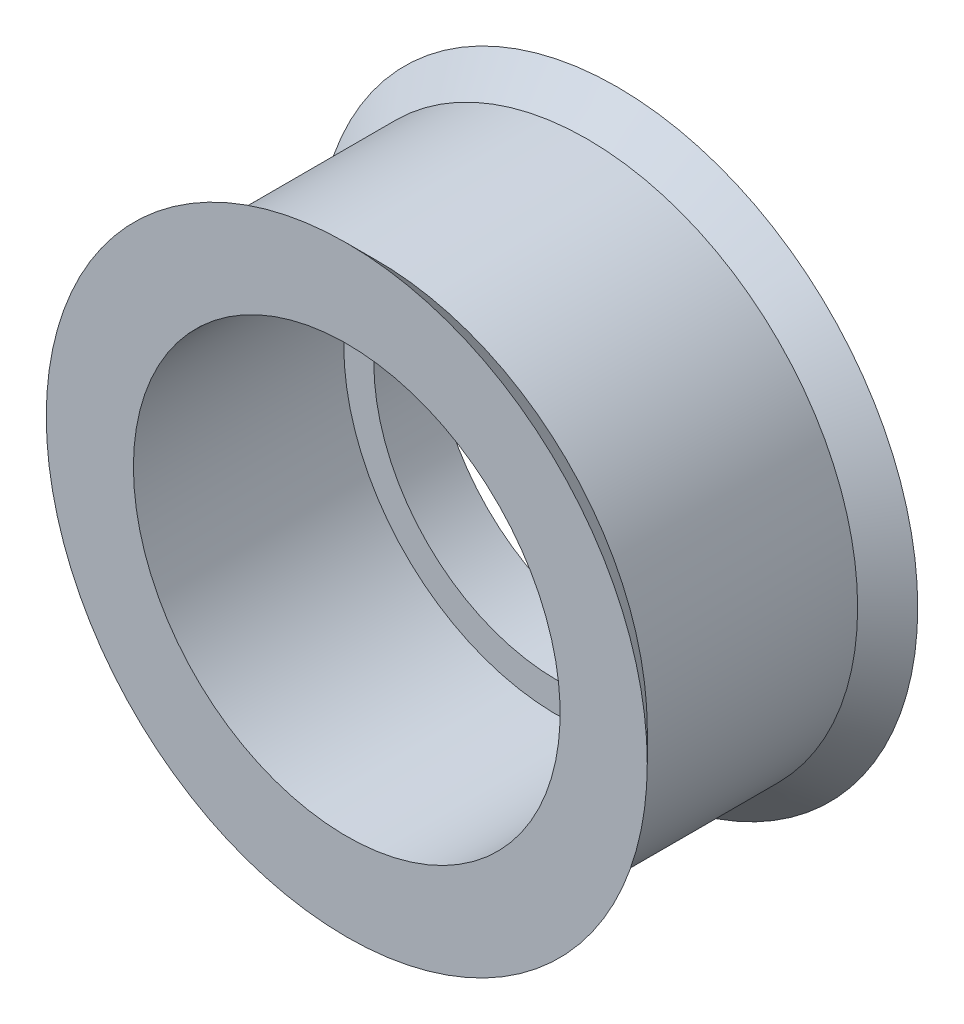
ISO-10303-21;
HEADER;
FILE_DESCRIPTION(('STEP AP214'),'2;1');
FILE_NAME('part.step','',(''),(''),'','','');
FILE_SCHEMA(('AUTOMOTIVE_DESIGN { 1 0 10303 214 1 1 1 1 }'));
ENDSEC;
DATA;
#1=APPLICATION_CONTEXT('core data for automotive mechanical design processes');
#2=APPLICATION_PROTOCOL_DEFINITION('international standard','automotive_design',2000,#1);
#3=PRODUCT_CONTEXT('',#1,'mechanical');
#4=PRODUCT('Part','Part','',(#3));
#5=PRODUCT_RELATED_PRODUCT_CATEGORY('part','',(#4));
#6=PRODUCT_DEFINITION_FORMATION('','',#4);
#7=PRODUCT_DEFINITION_CONTEXT('part definition',#1,'design');
#8=PRODUCT_DEFINITION('design','',#6,#7);
#9=PRODUCT_DEFINITION_SHAPE('','',#8);
#10=(LENGTH_UNIT() NAMED_UNIT(*) SI_UNIT(.MILLI.,.METRE.));
#11=(NAMED_UNIT(*) PLANE_ANGLE_UNIT() SI_UNIT($,.RADIAN.));
#12=(NAMED_UNIT(*) SI_UNIT($,.STERADIAN.) SOLID_ANGLE_UNIT());
#13=UNCERTAINTY_MEASURE_WITH_UNIT(LENGTH_MEASURE(1.E-05),#10,'distance_accuracy_value','');
#14=(GEOMETRIC_REPRESENTATION_CONTEXT(3) GLOBAL_UNCERTAINTY_ASSIGNED_CONTEXT((#13)) GLOBAL_UNIT_ASSIGNED_CONTEXT((#10,
#11,#12)) REPRESENTATION_CONTEXT('',''));
#15=CARTESIAN_POINT('',(0.,0.,0.));
#16=DIRECTION('',(0.,0.,1.));
#17=DIRECTION('',(1.,0.,0.));
#18=AXIS2_PLACEMENT_3D('',#15,#16,#17);
#19=CARTESIAN_POINT('',(0.,0.,-2.5));
#20=DIRECTION('',(0.,0.,-1.));
#21=DIRECTION('',(0.,1.,0.));
#22=AXIS2_PLACEMENT_3D('',#19,#20,#21);
#23=PLANE('',#22);
#24=CARTESIAN_POINT('',(0.,0.,-2.5));
#25=DIRECTION('',(0.,0.,-1.));
#26=DIRECTION('',(-1.,0.,0.));
#27=AXIS2_PLACEMENT_3D('',#24,#25,#26);
#28=CIRCLE('',#27,7.1);
#29=CARTESIAN_POINT('',(-7.1,0.,-2.5));
#30=VERTEX_POINT('',#29);
#31=EDGE_CURVE('E40',#30,#30,#28,.F.);
#32=ORIENTED_EDGE('',*,*,#31,.T.);
#33=EDGE_LOOP('',(#32));
#34=FACE_BOUND('',#33,.T.);
#35=CARTESIAN_POINT('',(0.,0.,-2.5));
#36=DIRECTION('',(0.,0.,-1.));
#37=DIRECTION('',(-1.,0.,0.));
#38=AXIS2_PLACEMENT_3D('',#35,#36,#37);
#39=CIRCLE('',#38,6.1);
#40=CARTESIAN_POINT('',(-6.1,0.,-2.5));
#41=VERTEX_POINT('',#40);
#42=EDGE_CURVE('E18',#41,#41,#39,.T.);
#43=ORIENTED_EDGE('',*,*,#42,.T.);
#44=EDGE_LOOP('',(#43));
#45=FACE_BOUND('',#44,.T.);
#46=ADVANCED_FACE('F15',(#34,#45),#23,.F.);
#47=CARTESIAN_POINT('',(0.,0.,-2.5));
#48=DIRECTION('',(0.,0.,-1.));
#49=DIRECTION('',(-1.,0.,0.));
#50=AXIS2_PLACEMENT_3D('',#47,#48,#49);
#51=CYLINDRICAL_SURFACE('',#50,6.1);
#52=ORIENTED_EDGE('',*,*,#42,.F.);
#53=EDGE_LOOP('',(#52));
#54=FACE_BOUND('',#53,.T.);
#55=CARTESIAN_POINT('',(0.,0.,-4.5));
#56=DIRECTION('',(0.,0.,-1.));
#57=DIRECTION('',(-1.,0.,0.));
#58=AXIS2_PLACEMENT_3D('',#55,#56,#57);
#59=CIRCLE('',#58,6.1);
#60=CARTESIAN_POINT('',(-6.1,0.,-4.5));
#61=VERTEX_POINT('',#60);
#62=EDGE_CURVE('E38',#61,#61,#59,.T.);
#63=ORIENTED_EDGE('',*,*,#62,.T.);
#64=EDGE_LOOP('',(#63));
#65=FACE_BOUND('',#64,.T.);
#66=ADVANCED_FACE('F48',(#54,#65),#51,.F.);
#67=CARTESIAN_POINT('',(0.,0.,4.5));
#68=DIRECTION('',(0.,0.,-1.));
#69=DIRECTION('',(-1.,0.,0.));
#70=AXIS2_PLACEMENT_3D('',#67,#68,#69);
#71=CYLINDRICAL_SURFACE('',#70,7.1);
#72=CARTESIAN_POINT('',(0.,0.,4.5));
#73=DIRECTION('',(0.,0.,-1.));
#74=DIRECTION('',(-1.,0.,0.));
#75=AXIS2_PLACEMENT_3D('',#72,#73,#74);
#76=CIRCLE('',#75,7.1);
#77=CARTESIAN_POINT('',(-7.1,0.,4.5));
#78=VERTEX_POINT('',#77);
#79=EDGE_CURVE('E35',#78,#78,#76,.T.);
#80=ORIENTED_EDGE('',*,*,#79,.F.);
#81=EDGE_LOOP('',(#80));
#82=FACE_BOUND('',#81,.T.);
#83=ORIENTED_EDGE('',*,*,#31,.F.);
#84=EDGE_LOOP('',(#83));
#85=FACE_BOUND('',#84,.T.);
#86=ADVANCED_FACE('F51',(#82,#85),#71,.F.);
#87=CARTESIAN_POINT('',(0.,0.,-4.5));
#88=DIRECTION('',(0.,0.,1.));
#89=DIRECTION('',(0.,-1.,0.));
#90=AXIS2_PLACEMENT_3D('',#87,#88,#89);
#91=PLANE('',#90);
#92=ORIENTED_EDGE('',*,*,#62,.F.);
#93=EDGE_LOOP('',(#92));
#94=FACE_BOUND('',#93,.T.);
#95=CARTESIAN_POINT('',(0.,0.,-4.5));
#96=DIRECTION('',(0.,0.,-1.));
#97=DIRECTION('',(-1.,0.,0.));
#98=AXIS2_PLACEMENT_3D('',#95,#96,#97);
#99=CIRCLE('',#98,9.99999999999999);
#100=CARTESIAN_POINT('',(-9.99999999999999,0.,-4.5));
#101=VERTEX_POINT('',#100);
#102=EDGE_CURVE('E32',#101,#101,#99,.F.);
#103=ORIENTED_EDGE('',*,*,#102,.F.);
#104=EDGE_LOOP('',(#103));
#105=FACE_BOUND('',#104,.T.);
#106=ADVANCED_FACE('F54',(#94,#105),#91,.F.);
#107=CARTESIAN_POINT('',(0.,0.,4.5));
#108=DIRECTION('',(0.,0.,1.));
#109=DIRECTION('',(0.,-1.,0.));
#110=AXIS2_PLACEMENT_3D('',#107,#108,#109);
#111=PLANE('',#110);
#112=CARTESIAN_POINT('',(0.,0.,4.5));
#113=DIRECTION('',(0.,0.,1.));
#114=DIRECTION('',(1.,0.,0.));
#115=AXIS2_PLACEMENT_3D('',#112,#113,#114);
#116=CIRCLE('',#115,9.99999999999999);
#117=CARTESIAN_POINT('',(9.99999999999999,0.,4.5));
#118=VERTEX_POINT('',#117);
#119=EDGE_CURVE('E27',#118,#118,#116,.F.);
#120=ORIENTED_EDGE('',*,*,#119,.F.);
#121=EDGE_LOOP('',(#120));
#122=FACE_BOUND('',#121,.T.);
#123=ORIENTED_EDGE('',*,*,#79,.T.);
#124=EDGE_LOOP('',(#123));
#125=FACE_BOUND('',#124,.T.);
#126=ADVANCED_FACE('F57',(#122,#125),#111,.T.);
#127=CARTESIAN_POINT('',(0.,0.,-4.5));
#128=DIRECTION('',(0.,0.,-1.));
#129=DIRECTION('',(-1.,0.,0.));
#130=AXIS2_PLACEMENT_3D('',#127,#128,#129);
#131=CONICAL_SURFACE('',#130,9.99999999999999,0.785398163397447);
#132=ORIENTED_EDGE('',*,*,#102,.T.);
#133=EDGE_LOOP('',(#132));
#134=FACE_BOUND('',#133,.T.);
#135=CARTESIAN_POINT('',(0.,0.,-3.5));
#136=DIRECTION('',(0.,0.,1.));
#137=DIRECTION('',(1.,0.,0.));
#138=AXIS2_PLACEMENT_3D('',#135,#136,#137);
#139=CIRCLE('',#138,8.99999999999999);
#140=CARTESIAN_POINT('',(8.99999999999999,0.,-3.5));
#141=VERTEX_POINT('',#140);
#142=EDGE_CURVE('E22',#141,#141,#139,.T.);
#143=ORIENTED_EDGE('',*,*,#142,.F.);
#144=EDGE_LOOP('',(#143));
#145=FACE_BOUND('',#144,.T.);
#146=ADVANCED_FACE('F61',(#134,#145),#131,.T.);
#147=CARTESIAN_POINT('',(0.,0.,4.5));
#148=DIRECTION('',(0.,0.,1.));
#149=DIRECTION('',(1.,0.,0.));
#150=AXIS2_PLACEMENT_3D('',#147,#148,#149);
#151=CONICAL_SURFACE('',#150,9.99999999999999,0.78539816339745);
#152=ORIENTED_EDGE('',*,*,#119,.T.);
#153=EDGE_LOOP('',(#152));
#154=FACE_BOUND('',#153,.T.);
#155=CARTESIAN_POINT('',(0.,0.,3.5));
#156=DIRECTION('',(0.,0.,1.));
#157=DIRECTION('',(1.,0.,0.));
#158=AXIS2_PLACEMENT_3D('',#155,#156,#157);
#159=CIRCLE('',#158,8.99999999999999);
#160=CARTESIAN_POINT('',(8.99999999999999,0.,3.5));
#161=VERTEX_POINT('',#160);
#162=EDGE_CURVE('E10',#161,#161,#159,.F.);
#163=ORIENTED_EDGE('',*,*,#162,.F.);
#164=EDGE_LOOP('',(#163));
#165=FACE_BOUND('',#164,.T.);
#166=ADVANCED_FACE('F64',(#154,#165),#151,.T.);
#167=CARTESIAN_POINT('',(0.,0.,-3.5));
#168=DIRECTION('',(0.,0.,1.));
#169=DIRECTION('',(1.,0.,0.));
#170=AXIS2_PLACEMENT_3D('',#167,#168,#169);
#171=CYLINDRICAL_SURFACE('',#170,8.99999999999999);
#172=ORIENTED_EDGE('',*,*,#162,.T.);
#173=EDGE_LOOP('',(#172));
#174=FACE_BOUND('',#173,.T.);
#175=ORIENTED_EDGE('',*,*,#142,.T.);
#176=EDGE_LOOP('',(#175));
#177=FACE_BOUND('',#176,.T.);
#178=ADVANCED_FACE('F68',(#174,#177),#171,.T.);
#179=CLOSED_SHELL('',(#46,#66,#86,#106,#126,#146,#166,#178));
#180=MANIFOLD_SOLID_BREP('B1',#179);
#181=ADVANCED_BREP_SHAPE_REPRESENTATION('',(#18,#180),#14);
#182=SHAPE_DEFINITION_REPRESENTATION(#9,#181);
ENDSEC;
END-ISO-10303-21;
